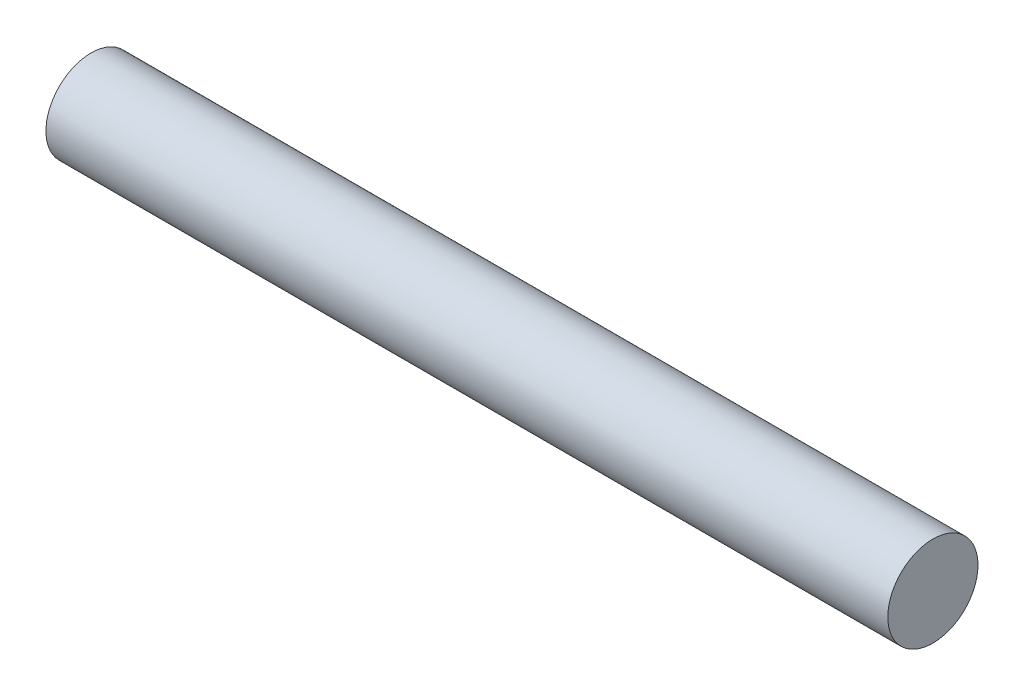
ISO-10303-21;
HEADER;
FILE_DESCRIPTION(('STEP AP214'),'2;1');
FILE_NAME('part.step','',(''),(''),'','','');
FILE_SCHEMA(('AUTOMOTIVE_DESIGN { 1 0 10303 214 1 1 1 1 }'));
ENDSEC;
DATA;
#1=APPLICATION_CONTEXT('core data for automotive mechanical design processes');
#2=APPLICATION_PROTOCOL_DEFINITION('international standard','automotive_design',2000,#1);
#3=PRODUCT_CONTEXT('',#1,'mechanical');
#4=PRODUCT('Part','Part','',(#3));
#5=PRODUCT_RELATED_PRODUCT_CATEGORY('part','',(#4));
#6=PRODUCT_DEFINITION_FORMATION('','',#4);
#7=PRODUCT_DEFINITION_CONTEXT('part definition',#1,'design');
#8=PRODUCT_DEFINITION('design','',#6,#7);
#9=PRODUCT_DEFINITION_SHAPE('','',#8);
#10=(LENGTH_UNIT() NAMED_UNIT(*) SI_UNIT(.MILLI.,.METRE.));
#11=(NAMED_UNIT(*) PLANE_ANGLE_UNIT() SI_UNIT($,.RADIAN.));
#12=(NAMED_UNIT(*) SI_UNIT($,.STERADIAN.) SOLID_ANGLE_UNIT());
#13=UNCERTAINTY_MEASURE_WITH_UNIT(LENGTH_MEASURE(1.E-05),#10,'distance_accuracy_value','');
#14=(GEOMETRIC_REPRESENTATION_CONTEXT(3) GLOBAL_UNCERTAINTY_ASSIGNED_CONTEXT((#13)) GLOBAL_UNIT_ASSIGNED_CONTEXT((#10,
#11,#12)) REPRESENTATION_CONTEXT('',''));
#15=CARTESIAN_POINT('',(0.,0.,0.));
#16=DIRECTION('',(0.,0.,1.));
#17=DIRECTION('',(1.,0.,0.));
#18=AXIS2_PLACEMENT_3D('',#15,#16,#17);
#19=CARTESIAN_POINT('',(14.,0.,0.));
#20=DIRECTION('',(-1.,0.,0.));
#21=DIRECTION('',(0.,0.,1.));
#22=AXIS2_PLACEMENT_3D('',#19,#20,#21);
#23=CYLINDRICAL_SURFACE('',#22,1.5);
#24=CARTESIAN_POINT('',(14.,0.,0.));
#25=DIRECTION('',(1.,0.,0.));
#26=DIRECTION('',(0.,0.,-1.));
#27=AXIS2_PLACEMENT_3D('',#24,#25,#26);
#28=CIRCLE('',#27,1.5);
#29=CARTESIAN_POINT('',(14.,0.,-1.5));
#30=VERTEX_POINT('',#29);
#31=EDGE_CURVE('E10',#30,#30,#28,.T.);
#32=ORIENTED_EDGE('',*,*,#31,.F.);
#33=EDGE_LOOP('',(#32));
#34=FACE_BOUND('',#33,.T.);
#35=CARTESIAN_POINT('',(-14.,0.,0.));
#36=DIRECTION('',(1.,0.,0.));
#37=DIRECTION('',(0.,0.,-1.));
#38=AXIS2_PLACEMENT_3D('',#35,#36,#37);
#39=CIRCLE('',#38,1.5);
#40=CARTESIAN_POINT('',(-14.,0.,-1.5));
#41=VERTEX_POINT('',#40);
#42=EDGE_CURVE('E32',#41,#41,#39,.T.);
#43=ORIENTED_EDGE('',*,*,#42,.T.);
#44=EDGE_LOOP('',(#43));
#45=FACE_BOUND('',#44,.T.);
#46=ADVANCED_FACE('F29',(#34,#45),#23,.T.);
#47=CARTESIAN_POINT('',(14.,0.,0.));
#48=DIRECTION('',(1.,0.,0.));
#49=DIRECTION('',(0.,0.,-1.));
#50=AXIS2_PLACEMENT_3D('',#47,#48,#49);
#51=PLANE('',#50);
#52=ORIENTED_EDGE('',*,*,#31,.T.);
#53=EDGE_LOOP('',(#52));
#54=FACE_BOUND('',#53,.T.);
#55=ADVANCED_FACE('F44',(#54),#51,.T.);
#56=CARTESIAN_POINT('',(-14.,0.,0.));
#57=DIRECTION('',(1.,0.,0.));
#58=DIRECTION('',(0.,0.,-1.));
#59=AXIS2_PLACEMENT_3D('',#56,#57,#58);
#60=PLANE('',#59);
#61=ORIENTED_EDGE('',*,*,#42,.F.);
#62=EDGE_LOOP('',(#61));
#63=FACE_BOUND('',#62,.T.);
#64=ADVANCED_FACE('F42',(#63),#60,.F.);
#65=CLOSED_SHELL('',(#46,#55,#64));
#66=MANIFOLD_SOLID_BREP('B2',#65);
#67=ADVANCED_BREP_SHAPE_REPRESENTATION('',(#18,#66),#14);
#68=SHAPE_DEFINITION_REPRESENTATION(#9,#67);
ENDSEC;
END-ISO-10303-21;
